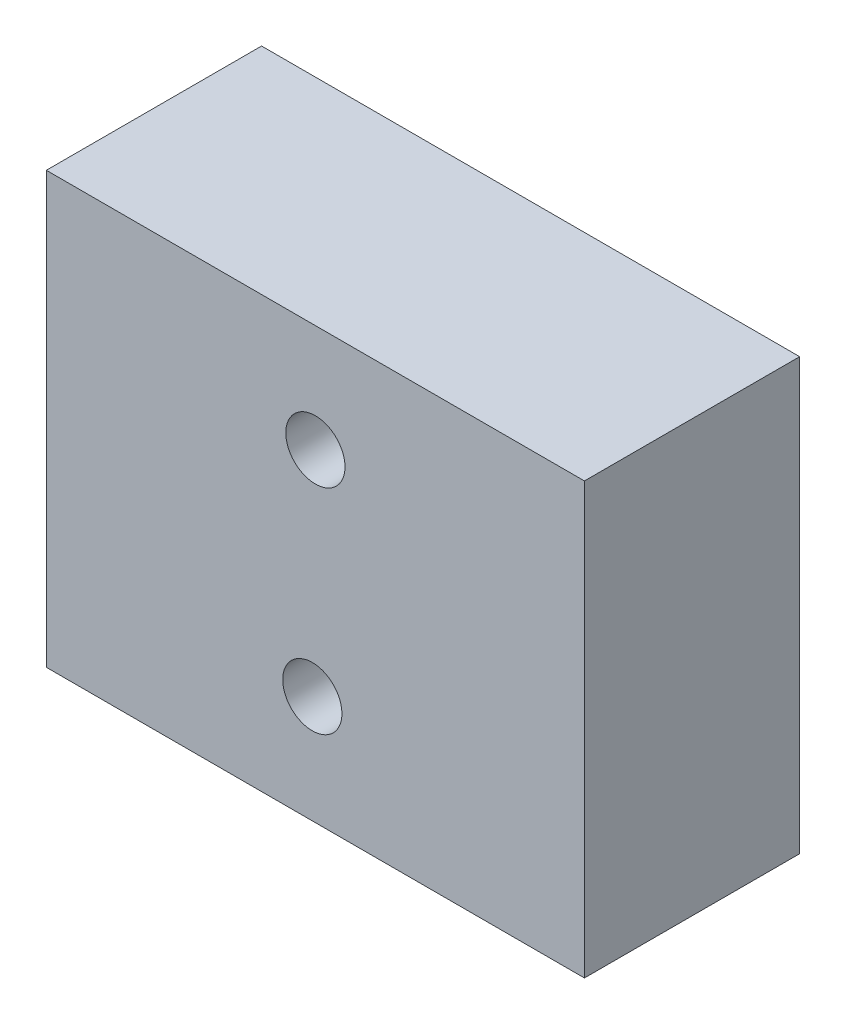
ISO-10303-21;
HEADER;
FILE_DESCRIPTION(('STEP AP214'),'2;1');
FILE_NAME('part.step','',(''),(''),'','','');
FILE_SCHEMA(('AUTOMOTIVE_DESIGN { 1 0 10303 214 1 1 1 1 }'));
ENDSEC;
DATA;
#1=APPLICATION_CONTEXT('core data for automotive mechanical design processes');
#2=APPLICATION_PROTOCOL_DEFINITION('international standard','automotive_design',2000,#1);
#3=PRODUCT_CONTEXT('',#1,'mechanical');
#4=PRODUCT('Part','Part','',(#3));
#5=PRODUCT_RELATED_PRODUCT_CATEGORY('part','',(#4));
#6=PRODUCT_DEFINITION_FORMATION('','',#4);
#7=PRODUCT_DEFINITION_CONTEXT('part definition',#1,'design');
#8=PRODUCT_DEFINITION('design','',#6,#7);
#9=PRODUCT_DEFINITION_SHAPE('','',#8);
#10=(LENGTH_UNIT() NAMED_UNIT(*) SI_UNIT(.MILLI.,.METRE.));
#11=(NAMED_UNIT(*) PLANE_ANGLE_UNIT() SI_UNIT($,.RADIAN.));
#12=(NAMED_UNIT(*) SI_UNIT($,.STERADIAN.) SOLID_ANGLE_UNIT());
#13=UNCERTAINTY_MEASURE_WITH_UNIT(LENGTH_MEASURE(1.E-05),#10,'distance_accuracy_value','');
#14=(GEOMETRIC_REPRESENTATION_CONTEXT(3) GLOBAL_UNCERTAINTY_ASSIGNED_CONTEXT((#13)) GLOBAL_UNIT_ASSIGNED_CONTEXT((#10,
#11,#12)) REPRESENTATION_CONTEXT('',''));
#15=CARTESIAN_POINT('',(0.,0.,0.));
#16=DIRECTION('',(0.,0.,1.));
#17=DIRECTION('',(1.,0.,0.));
#18=AXIS2_PLACEMENT_3D('',#15,#16,#17);
#19=CARTESIAN_POINT('',(0.,40.,0.));
#20=DIRECTION('',(1.,0.,0.));
#21=DIRECTION('',(0.,0.,-1.));
#22=AXIS2_PLACEMENT_3D('',#19,#20,#21);
#23=PLANE('',#22);
#24=DIRECTION('',(0.,0.,1.));
#25=VECTOR('',#24,1.);
#26=CARTESIAN_POINT('',(0.,0.,0.));
#27=LINE('',#26,#25);
#28=CARTESIAN_POINT('',(0.,0.,-20.));
#29=VERTEX_POINT('',#28);
#30=CARTESIAN_POINT('',(0.,0.,0.));
#31=VERTEX_POINT('',#30);
#32=EDGE_CURVE('E153',#29,#31,#27,.T.);
#33=ORIENTED_EDGE('',*,*,#32,.T.);
#34=DIRECTION('',(0.,-1.,0.));
#35=VECTOR('',#34,1.);
#36=CARTESIAN_POINT('',(0.,40.,0.));
#37=LINE('',#36,#35);
#38=CARTESIAN_POINT('',(0.,40.,0.));
#39=VERTEX_POINT('',#38);
#40=EDGE_CURVE('E11',#39,#31,#37,.T.);
#41=ORIENTED_EDGE('',*,*,#40,.F.);
#42=DIRECTION('',(0.,0.,1.));
#43=VECTOR('',#42,1.);
#44=CARTESIAN_POINT('',(0.,40.,0.));
#45=LINE('',#44,#43);
#46=CARTESIAN_POINT('',(0.,40.,-20.));
#47=VERTEX_POINT('',#46);
#48=EDGE_CURVE('E154',#47,#39,#45,.T.);
#49=ORIENTED_EDGE('',*,*,#48,.F.);
#50=DIRECTION('',(0.,-1.,0.));
#51=VECTOR('',#50,1.);
#52=CARTESIAN_POINT('',(0.,40.,-20.));
#53=LINE('',#52,#51);
#54=EDGE_CURVE('E164',#47,#29,#53,.T.);
#55=ORIENTED_EDGE('',*,*,#54,.T.);
#56=EDGE_LOOP('',(#33,#41,#49,#55));
#57=FACE_BOUND('',#56,.T.);
#58=ADVANCED_FACE('F40',(#57),#23,.F.);
#59=CARTESIAN_POINT('',(0.,40.,0.));
#60=DIRECTION('',(0.,0.,-1.));
#61=DIRECTION('',(-1.,0.,0.));
#62=AXIS2_PLACEMENT_3D('',#59,#60,#61);
#63=PLANE('',#62);
#64=CARTESIAN_POINT('',(25.,30.,0.));
#65=DIRECTION('',(0.,0.,1.));
#66=DIRECTION('',(1.,0.,0.));
#67=AXIS2_PLACEMENT_3D('',#64,#65,#66);
#68=CIRCLE('',#67,2.74999999999999);
#69=CARTESIAN_POINT('',(27.75,30.,0.));
#70=VERTEX_POINT('',#69);
#71=EDGE_CURVE('E137',#70,#70,#68,.T.);
#72=ORIENTED_EDGE('',*,*,#71,.F.);
#73=EDGE_LOOP('',(#72));
#74=FACE_BOUND('',#73,.T.);
#75=CARTESIAN_POINT('',(24.7158090744875,10.,0.));
#76=DIRECTION('',(0.,0.,1.));
#77=DIRECTION('',(1.,0.,0.));
#78=AXIS2_PLACEMENT_3D('',#75,#76,#77);
#79=CIRCLE('',#78,2.74999999999999);
#80=CARTESIAN_POINT('',(27.4658090744875,10.,0.));
#81=VERTEX_POINT('',#80);
#82=EDGE_CURVE('E145',#81,#81,#79,.T.);
#83=ORIENTED_EDGE('',*,*,#82,.F.);
#84=EDGE_LOOP('',(#83));
#85=FACE_BOUND('',#84,.T.);
#86=DIRECTION('',(1.,0.,0.));
#87=VECTOR('',#86,1.);
#88=CARTESIAN_POINT('',(0.,0.,0.));
#89=LINE('',#88,#87);
#90=CARTESIAN_POINT('',(50.,0.,0.));
#91=VERTEX_POINT('',#90);
#92=EDGE_CURVE('E168',#31,#91,#89,.T.);
#93=ORIENTED_EDGE('',*,*,#92,.T.);
#94=DIRECTION('',(0.,-1.,0.));
#95=VECTOR('',#94,1.);
#96=CARTESIAN_POINT('',(50.,40.,0.));
#97=LINE('',#96,#95);
#98=CARTESIAN_POINT('',(50.,40.,0.));
#99=VERTEX_POINT('',#98);
#100=EDGE_CURVE('E49',#99,#91,#97,.T.);
#101=ORIENTED_EDGE('',*,*,#100,.F.);
#102=DIRECTION('',(1.,0.,0.));
#103=VECTOR('',#102,1.);
#104=CARTESIAN_POINT('',(0.,40.,0.));
#105=LINE('',#104,#103);
#106=EDGE_CURVE('E97',#39,#99,#105,.T.);
#107=ORIENTED_EDGE('',*,*,#106,.F.);
#108=ORIENTED_EDGE('',*,*,#40,.T.);
#109=EDGE_LOOP('',(#93,#101,#107,#108));
#110=FACE_BOUND('',#109,.T.);
#111=ADVANCED_FACE('F197',(#74,#85,#110),#63,.F.);
#112=CARTESIAN_POINT('',(50.,40.,0.));
#113=DIRECTION('',(-1.,0.,0.));
#114=DIRECTION('',(0.,0.,1.));
#115=AXIS2_PLACEMENT_3D('',#112,#113,#114);
#116=PLANE('',#115);
#117=DIRECTION('',(0.,0.,-1.));
#118=VECTOR('',#117,1.);
#119=CARTESIAN_POINT('',(50.,0.,0.));
#120=LINE('',#119,#118);
#121=CARTESIAN_POINT('',(50.,0.,-20.));
#122=VERTEX_POINT('',#121);
#123=EDGE_CURVE('E82',#91,#122,#120,.T.);
#124=ORIENTED_EDGE('',*,*,#123,.T.);
#125=DIRECTION('',(0.,-1.,0.));
#126=VECTOR('',#125,1.);
#127=CARTESIAN_POINT('',(50.,40.,-20.));
#128=LINE('',#127,#126);
#129=CARTESIAN_POINT('',(50.,40.,-20.));
#130=VERTEX_POINT('',#129);
#131=EDGE_CURVE('E177',#130,#122,#128,.T.);
#132=ORIENTED_EDGE('',*,*,#131,.F.);
#133=DIRECTION('',(0.,0.,-1.));
#134=VECTOR('',#133,1.);
#135=CARTESIAN_POINT('',(50.,40.,0.));
#136=LINE('',#135,#134);
#137=EDGE_CURVE('E159',#99,#130,#136,.T.);
#138=ORIENTED_EDGE('',*,*,#137,.F.);
#139=ORIENTED_EDGE('',*,*,#100,.T.);
#140=EDGE_LOOP('',(#124,#132,#138,#139));
#141=FACE_BOUND('',#140,.T.);
#142=ADVANCED_FACE('F180',(#141),#116,.F.);
#143=CARTESIAN_POINT('',(0.,40.,-20.));
#144=DIRECTION('',(0.,0.,1.));
#145=DIRECTION('',(1.,0.,0.));
#146=AXIS2_PLACEMENT_3D('',#143,#144,#145);
#147=PLANE('',#146);
#148=CARTESIAN_POINT('',(25.,30.,-20.));
#149=DIRECTION('',(0.,0.,1.));
#150=DIRECTION('',(1.,0.,0.));
#151=AXIS2_PLACEMENT_3D('',#148,#149,#150);
#152=CIRCLE('',#151,2.74999999999999);
#153=CARTESIAN_POINT('',(27.75,30.,-20.));
#154=VERTEX_POINT('',#153);
#155=EDGE_CURVE('E141',#154,#154,#152,.T.);
#156=ORIENTED_EDGE('',*,*,#155,.T.);
#157=EDGE_LOOP('',(#156));
#158=FACE_BOUND('',#157,.T.);
#159=CARTESIAN_POINT('',(24.7158090744875,10.,-20.));
#160=DIRECTION('',(0.,0.,1.));
#161=DIRECTION('',(1.,0.,0.));
#162=AXIS2_PLACEMENT_3D('',#159,#160,#161);
#163=CIRCLE('',#162,2.74999999999999);
#164=CARTESIAN_POINT('',(27.4658090744875,10.,-20.));
#165=VERTEX_POINT('',#164);
#166=EDGE_CURVE('E149',#165,#165,#163,.T.);
#167=ORIENTED_EDGE('',*,*,#166,.T.);
#168=EDGE_LOOP('',(#167));
#169=FACE_BOUND('',#168,.T.);
#170=DIRECTION('',(-1.,0.,0.));
#171=VECTOR('',#170,1.);
#172=CARTESIAN_POINT('',(0.,0.,-20.));
#173=LINE('',#172,#171);
#174=EDGE_CURVE('E90',#122,#29,#173,.T.);
#175=ORIENTED_EDGE('',*,*,#174,.T.);
#176=ORIENTED_EDGE('',*,*,#54,.F.);
#177=DIRECTION('',(-1.,0.,0.));
#178=VECTOR('',#177,1.);
#179=CARTESIAN_POINT('',(0.,40.,-20.));
#180=LINE('',#179,#178);
#181=EDGE_CURVE('E60',#130,#47,#180,.T.);
#182=ORIENTED_EDGE('',*,*,#181,.F.);
#183=ORIENTED_EDGE('',*,*,#131,.T.);
#184=EDGE_LOOP('',(#175,#176,#182,#183));
#185=FACE_BOUND('',#184,.T.);
#186=ADVANCED_FACE('F187',(#158,#169,#185),#147,.F.);
#187=CARTESIAN_POINT('',(0.,40.,0.));
#188=DIRECTION('',(0.,-1.,0.));
#189=DIRECTION('',(0.,0.,-1.));
#190=AXIS2_PLACEMENT_3D('',#187,#188,#189);
#191=PLANE('',#190);
#192=ORIENTED_EDGE('',*,*,#48,.T.);
#193=ORIENTED_EDGE('',*,*,#106,.T.);
#194=ORIENTED_EDGE('',*,*,#137,.T.);
#195=ORIENTED_EDGE('',*,*,#181,.T.);
#196=EDGE_LOOP('',(#192,#193,#194,#195));
#197=FACE_BOUND('',#196,.T.);
#198=ADVANCED_FACE('F189',(#197),#191,.F.);
#199=CARTESIAN_POINT('',(0.,0.,0.));
#200=DIRECTION('',(0.,-1.,0.));
#201=DIRECTION('',(0.,0.,-1.));
#202=AXIS2_PLACEMENT_3D('',#199,#200,#201);
#203=PLANE('',#202);
#204=CARTESIAN_POINT('',(40.,0.,-10.));
#205=DIRECTION('',(0.,-1.,0.));
#206=DIRECTION('',(0.,0.,-1.));
#207=AXIS2_PLACEMENT_3D('',#204,#205,#206);
#208=CIRCLE('',#207,3.8603936);
#209=CARTESIAN_POINT('',(40.,0.,-13.8603936));
#210=VERTEX_POINT('',#209);
#211=EDGE_CURVE('E126',#210,#210,#208,.T.);
#212=ORIENTED_EDGE('',*,*,#211,.F.);
#213=EDGE_LOOP('',(#212));
#214=FACE_BOUND('',#213,.T.);
#215=CARTESIAN_POINT('',(9.,0.,-10.));
#216=DIRECTION('',(0.,-1.,0.));
#217=DIRECTION('',(0.,0.,-1.));
#218=AXIS2_PLACEMENT_3D('',#215,#216,#217);
#219=CIRCLE('',#218,3.8603936);
#220=CARTESIAN_POINT('',(9.,0.,-13.8603936));
#221=VERTEX_POINT('',#220);
#222=EDGE_CURVE('E116',#221,#221,#219,.T.);
#223=ORIENTED_EDGE('',*,*,#222,.F.);
#224=EDGE_LOOP('',(#223));
#225=FACE_BOUND('',#224,.T.);
#226=ORIENTED_EDGE('',*,*,#32,.F.);
#227=ORIENTED_EDGE('',*,*,#174,.F.);
#228=ORIENTED_EDGE('',*,*,#123,.F.);
#229=ORIENTED_EDGE('',*,*,#92,.F.);
#230=EDGE_LOOP('',(#226,#227,#228,#229));
#231=FACE_BOUND('',#230,.T.);
#232=ADVANCED_FACE('F183',(#214,#225,#231),#203,.T.);
#233=CARTESIAN_POINT('',(24.7158090744875,10.,0.));
#234=DIRECTION('',(0.,0.,1.));
#235=DIRECTION('',(1.,0.,0.));
#236=AXIS2_PLACEMENT_3D('',#233,#234,#235);
#237=CYLINDRICAL_SURFACE('',#236,2.74999999999999);
#238=ORIENTED_EDGE('',*,*,#166,.F.);
#239=EDGE_LOOP('',(#238));
#240=FACE_BOUND('',#239,.T.);
#241=ORIENTED_EDGE('',*,*,#82,.T.);
#242=EDGE_LOOP('',(#241));
#243=FACE_BOUND('',#242,.T.);
#244=ADVANCED_FACE('F212',(#240,#243),#237,.F.);
#245=CARTESIAN_POINT('',(25.,30.,0.));
#246=DIRECTION('',(0.,0.,1.));
#247=DIRECTION('',(1.,0.,0.));
#248=AXIS2_PLACEMENT_3D('',#245,#246,#247);
#249=CYLINDRICAL_SURFACE('',#248,2.74999999999999);
#250=ORIENTED_EDGE('',*,*,#155,.F.);
#251=EDGE_LOOP('',(#250));
#252=FACE_BOUND('',#251,.T.);
#253=ORIENTED_EDGE('',*,*,#71,.T.);
#254=EDGE_LOOP('',(#253));
#255=FACE_BOUND('',#254,.T.);
#256=ADVANCED_FACE('F214',(#252,#255),#249,.F.);
#257=CARTESIAN_POINT('',(9.,12.,-10.));
#258=DIRECTION('',(0.,-1.,0.));
#259=DIRECTION('',(0.,0.,-1.));
#260=AXIS2_PLACEMENT_3D('',#257,#258,#259);
#261=CONICAL_SURFACE('',#260,3.8354,1.02974425867665);
#262=CARTESIAN_POINT('',(9.,14.3045408182183,-10.));
#263=VERTEX_POINT('',#262);
#264=VERTEX_LOOP('',#263);
#265=FACE_BOUND('',#264,.T.);
#266=CARTESIAN_POINT('',(9.,12.,-10.));
#267=DIRECTION('',(0.,-1.,0.));
#268=DIRECTION('',(0.,0.,-1.));
#269=AXIS2_PLACEMENT_3D('',#266,#267,#268);
#270=CIRCLE('',#269,3.8354);
#271=CARTESIAN_POINT('',(9.,12.,-13.8354));
#272=VERTEX_POINT('',#271);
#273=EDGE_CURVE('E133',#272,#272,#270,.T.);
#274=ORIENTED_EDGE('',*,*,#273,.T.);
#275=EDGE_LOOP('',(#274));
#276=FACE_BOUND('',#275,.T.);
#277=ADVANCED_FACE('F221',(#265,#276),#261,.F.);
#278=CARTESIAN_POINT('',(9.,0.,-10.));
#279=DIRECTION('',(0.,-1.,0.));
#280=DIRECTION('',(0.,0.,-1.));
#281=AXIS2_PLACEMENT_3D('',#278,#279,#280);
#282=CYLINDRICAL_SURFACE('',#281,3.8354);
#283=ORIENTED_EDGE('',*,*,#273,.F.);
#284=EDGE_LOOP('',(#283));
#285=FACE_BOUND('',#284,.T.);
#286=CARTESIAN_POINT('',(9.,0.715723060051965,-10.));
#287=DIRECTION('',(0.,-1.,0.));
#288=DIRECTION('',(0.,0.,-1.));
#289=AXIS2_PLACEMENT_3D('',#286,#287,#288);
#290=CIRCLE('',#289,3.8354);
#291=CARTESIAN_POINT('',(9.,0.715723060051965,-13.8354));
#292=VERTEX_POINT('',#291);
#293=EDGE_CURVE('E123',#292,#292,#290,.T.);
#294=ORIENTED_EDGE('',*,*,#293,.T.);
#295=EDGE_LOOP('',(#294));
#296=FACE_BOUND('',#295,.T.);
#297=ADVANCED_FACE('F229',(#285,#296),#282,.F.);
#298=CARTESIAN_POINT('',(9.,0.,-10.));
#299=DIRECTION('',(0.,-1.,0.));
#300=DIRECTION('',(0.,0.,-1.));
#301=AXIS2_PLACEMENT_3D('',#298,#299,#300);
#302=CONICAL_SURFACE('',#301,3.8603936,0.0349065850398876);
#303=ORIENTED_EDGE('',*,*,#293,.F.);
#304=EDGE_LOOP('',(#303));
#305=FACE_BOUND('',#304,.T.);
#306=ORIENTED_EDGE('',*,*,#222,.T.);
#307=EDGE_LOOP('',(#306));
#308=FACE_BOUND('',#307,.T.);
#309=ADVANCED_FACE('F109',(#305,#308),#302,.F.);
#310=CARTESIAN_POINT('',(40.,12.,-10.));
#311=DIRECTION('',(0.,-1.,0.));
#312=DIRECTION('',(0.,0.,-1.));
#313=AXIS2_PLACEMENT_3D('',#310,#311,#312);
#314=CONICAL_SURFACE('',#313,3.8354,1.02974425867665);
#315=CARTESIAN_POINT('',(40.,14.3045408182183,-10.));
#316=VERTEX_POINT('',#315);
#317=VERTEX_LOOP('',#316);
#318=FACE_BOUND('',#317,.T.);
#319=CARTESIAN_POINT('',(40.,12.,-10.));
#320=DIRECTION('',(0.,-1.,0.));
#321=DIRECTION('',(0.,0.,-1.));
#322=AXIS2_PLACEMENT_3D('',#319,#320,#321);
#323=CIRCLE('',#322,3.8354);
#324=CARTESIAN_POINT('',(40.,12.,-13.8354));
#325=VERTEX_POINT('',#324);
#326=EDGE_CURVE('E113',#325,#325,#323,.T.);
#327=ORIENTED_EDGE('',*,*,#326,.T.);
#328=EDGE_LOOP('',(#327));
#329=FACE_BOUND('',#328,.T.);
#330=ADVANCED_FACE('F105',(#318,#329),#314,.F.);
#331=CARTESIAN_POINT('',(40.,0.,-10.));
#332=DIRECTION('',(0.,-1.,0.));
#333=DIRECTION('',(0.,0.,-1.));
#334=AXIS2_PLACEMENT_3D('',#331,#332,#333);
#335=CYLINDRICAL_SURFACE('',#334,3.8354);
#336=ORIENTED_EDGE('',*,*,#326,.F.);
#337=EDGE_LOOP('',(#336));
#338=FACE_BOUND('',#337,.T.);
#339=CARTESIAN_POINT('',(40.,0.715723060051965,-10.));
#340=DIRECTION('',(0.,-1.,0.));
#341=DIRECTION('',(0.,0.,-1.));
#342=AXIS2_PLACEMENT_3D('',#339,#340,#341);
#343=CIRCLE('',#342,3.8354);
#344=CARTESIAN_POINT('',(40.,0.715723060051965,-13.8354));
#345=VERTEX_POINT('',#344);
#346=EDGE_CURVE('E117',#345,#345,#343,.T.);
#347=ORIENTED_EDGE('',*,*,#346,.T.);
#348=EDGE_LOOP('',(#347));
#349=FACE_BOUND('',#348,.T.);
#350=ADVANCED_FACE('F108',(#338,#349),#335,.F.);
#351=CARTESIAN_POINT('',(40.,0.,-10.));
#352=DIRECTION('',(0.,-1.,0.));
#353=DIRECTION('',(0.,0.,-1.));
#354=AXIS2_PLACEMENT_3D('',#351,#352,#353);
#355=CONICAL_SURFACE('',#354,3.8603936,0.0349065850398851);
#356=ORIENTED_EDGE('',*,*,#346,.F.);
#357=EDGE_LOOP('',(#356));
#358=FACE_BOUND('',#357,.T.);
#359=ORIENTED_EDGE('',*,*,#211,.T.);
#360=EDGE_LOOP('',(#359));
#361=FACE_BOUND('',#360,.T.);
#362=ADVANCED_FACE('F239',(#358,#361),#355,.F.);
#363=CLOSED_SHELL('',(#58,#111,#142,#186,#198,#232,#244,#256,#277,#297,#309,#330,#350,#362));
#364=MANIFOLD_SOLID_BREP('B2',#363);
#365=ADVANCED_BREP_SHAPE_REPRESENTATION('',(#18,#364),#14);
#366=SHAPE_DEFINITION_REPRESENTATION(#9,#365);
ENDSEC;
END-ISO-10303-21;
